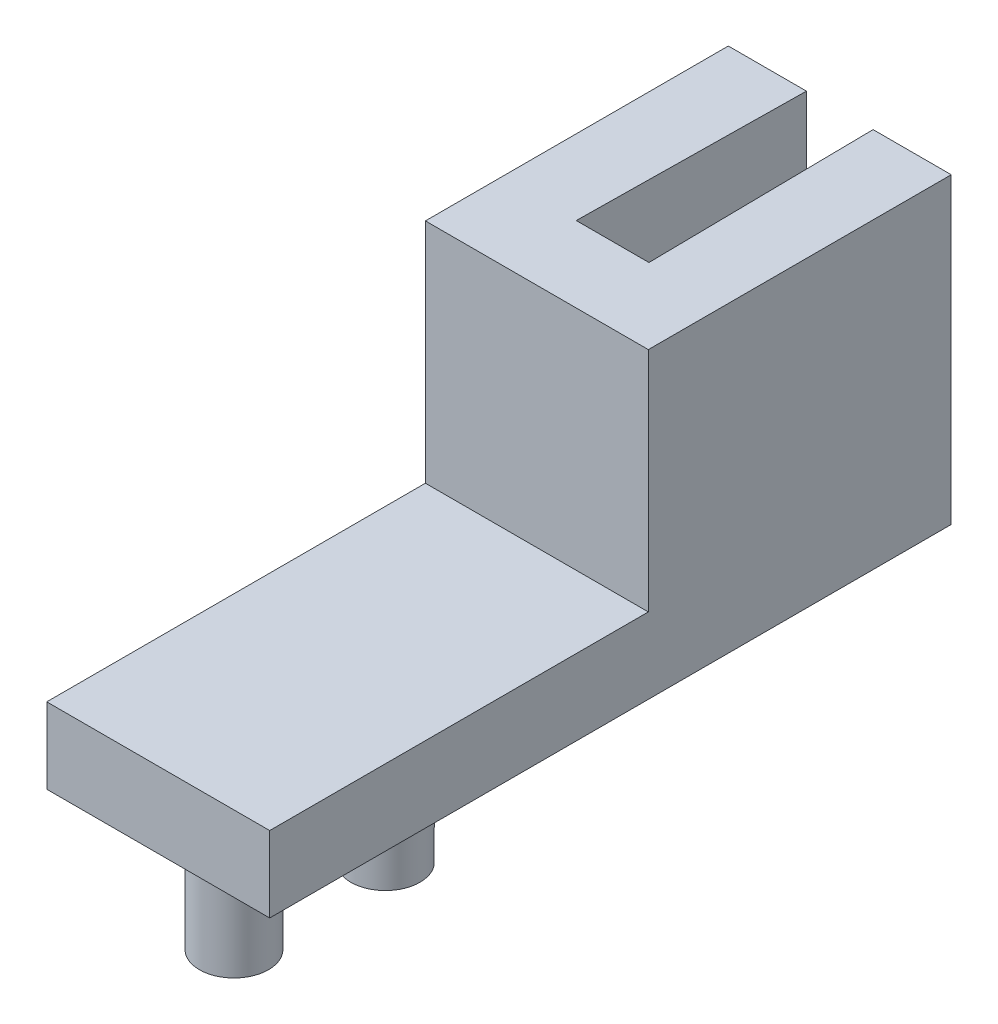
ISO-10303-21;
HEADER;
FILE_DESCRIPTION(('STEP AP214'),'2;1');
FILE_NAME('part.step','',(''),(''),'','','');
FILE_SCHEMA(('AUTOMOTIVE_DESIGN { 1 0 10303 214 1 1 1 1 }'));
ENDSEC;
DATA;
#1=APPLICATION_CONTEXT('core data for automotive mechanical design processes');
#2=APPLICATION_PROTOCOL_DEFINITION('international standard','automotive_design',2000,#1);
#3=PRODUCT_CONTEXT('',#1,'mechanical');
#4=PRODUCT('Part','Part','',(#3));
#5=PRODUCT_RELATED_PRODUCT_CATEGORY('part','',(#4));
#6=PRODUCT_DEFINITION_FORMATION('','',#4);
#7=PRODUCT_DEFINITION_CONTEXT('part definition',#1,'design');
#8=PRODUCT_DEFINITION('design','',#6,#7);
#9=PRODUCT_DEFINITION_SHAPE('','',#8);
#10=(LENGTH_UNIT() NAMED_UNIT(*) SI_UNIT(.MILLI.,.METRE.));
#11=(NAMED_UNIT(*) PLANE_ANGLE_UNIT() SI_UNIT($,.RADIAN.));
#12=(NAMED_UNIT(*) SI_UNIT($,.STERADIAN.) SOLID_ANGLE_UNIT());
#13=UNCERTAINTY_MEASURE_WITH_UNIT(LENGTH_MEASURE(1.E-05),#10,'distance_accuracy_value','');
#14=(GEOMETRIC_REPRESENTATION_CONTEXT(3) GLOBAL_UNCERTAINTY_ASSIGNED_CONTEXT((#13)) GLOBAL_UNIT_ASSIGNED_CONTEXT((#10,
#11,#12)) REPRESENTATION_CONTEXT('',''));
#15=CARTESIAN_POINT('',(0.,0.,0.));
#16=DIRECTION('',(0.,0.,1.));
#17=DIRECTION('',(1.,0.,0.));
#18=AXIS2_PLACEMENT_3D('',#15,#16,#17);
#19=CARTESIAN_POINT('',(9.3472,-3.175,0.));
#20=DIRECTION('',(0.,1.,0.));
#21=DIRECTION('',(0.,0.,1.));
#22=AXIS2_PLACEMENT_3D('',#19,#20,#21);
#23=PLANE('',#22);
#24=CARTESIAN_POINT('',(4.6736,-3.175,6.35));
#25=DIRECTION('',(0.,1.,0.));
#26=DIRECTION('',(0.,0.,1.));
#27=AXIS2_PLACEMENT_3D('',#24,#25,#26);
#28=CIRCLE('',#27,1.45);
#29=CARTESIAN_POINT('',(4.6736,-3.175,7.8));
#30=VERTEX_POINT('',#29);
#31=EDGE_CURVE('E11',#30,#30,#28,.F.);
#32=ORIENTED_EDGE('',*,*,#31,.F.);
#33=EDGE_LOOP('',(#32));
#34=FACE_BOUND('',#33,.T.);
#35=CARTESIAN_POINT('',(4.6736,-3.175,12.7));
#36=DIRECTION('',(0.,1.,0.));
#37=DIRECTION('',(0.,0.,1.));
#38=AXIS2_PLACEMENT_3D('',#35,#36,#37);
#39=CIRCLE('',#38,1.45);
#40=CARTESIAN_POINT('',(4.6736,-3.175,14.15));
#41=VERTEX_POINT('',#40);
#42=EDGE_CURVE('E49',#41,#41,#39,.F.);
#43=ORIENTED_EDGE('',*,*,#42,.F.);
#44=EDGE_LOOP('',(#43));
#45=FACE_BOUND('',#44,.T.);
#46=DIRECTION('',(0.0133321483061494,0.,0.999911122961207));
#47=VECTOR('',#46,1.);
#48=CARTESIAN_POINT('',(6.23882420902951,-3.175,-0.0831843227870598));
#49=LINE('',#48,#47);
#50=CARTESIAN_POINT('',(6.0706,-3.175,-12.7));
#51=VERTEX_POINT('',#50);
#52=CARTESIAN_POINT('',(6.1976,-3.175,-3.175));
#53=VERTEX_POINT('',#52);
#54=EDGE_CURVE('E192',#51,#53,#49,.T.);
#55=ORIENTED_EDGE('',*,*,#54,.F.);
#56=DIRECTION('',(-1.,0.,0.));
#57=VECTOR('',#56,1.);
#58=CARTESIAN_POINT('',(9.3472,-3.175,-12.7));
#59=LINE('',#58,#57);
#60=CARTESIAN_POINT('',(9.3472,-3.175,-12.7));
#61=VERTEX_POINT('',#60);
#62=EDGE_CURVE('E175',#61,#51,#59,.T.);
#63=ORIENTED_EDGE('',*,*,#62,.F.);
#64=DIRECTION('',(0.,0.,-1.));
#65=VECTOR('',#64,1.);
#66=CARTESIAN_POINT('',(9.3472,-3.175,0.));
#67=LINE('',#66,#65);
#68=CARTESIAN_POINT('',(9.3472,-3.175,15.875));
#69=VERTEX_POINT('',#68);
#70=EDGE_CURVE('E162',#69,#61,#67,.T.);
#71=ORIENTED_EDGE('',*,*,#70,.F.);
#72=DIRECTION('',(-1.,0.,0.));
#73=VECTOR('',#72,1.);
#74=CARTESIAN_POINT('',(9.3472,-3.175,15.875));
#75=LINE('',#74,#73);
#76=CARTESIAN_POINT('',(0.,-3.175,15.875));
#77=VERTEX_POINT('',#76);
#78=EDGE_CURVE('E138',#69,#77,#75,.T.);
#79=ORIENTED_EDGE('',*,*,#78,.T.);
#80=DIRECTION('',(0.,0.,-1.));
#81=VECTOR('',#80,1.);
#82=CARTESIAN_POINT('',(0.,-3.175,0.));
#83=LINE('',#82,#81);
#84=CARTESIAN_POINT('',(0.,-3.175,-12.7));
#85=VERTEX_POINT('',#84);
#86=EDGE_CURVE('E142',#77,#85,#83,.T.);
#87=ORIENTED_EDGE('',*,*,#86,.T.);
#88=CARTESIAN_POINT('',(3.2766,-3.175,-12.7));
#89=VERTEX_POINT('',#88);
#90=EDGE_CURVE('E174',#89,#85,#59,.T.);
#91=ORIENTED_EDGE('',*,*,#90,.F.);
#92=DIRECTION('',(-0.0133321483061496,0.,0.999911122961207));
#93=VECTOR('',#92,1.);
#94=CARTESIAN_POINT('',(3.10671436189122,-3.175,0.04142285815855));
#95=LINE('',#94,#93);
#96=CARTESIAN_POINT('',(3.1496,-3.175,-3.175));
#97=VERTEX_POINT('',#96);
#98=EDGE_CURVE('E204',#89,#97,#95,.T.);
#99=ORIENTED_EDGE('',*,*,#98,.T.);
#100=DIRECTION('',(1.,0.,0.));
#101=VECTOR('',#100,1.);
#102=CARTESIAN_POINT('',(0.,-3.175,-3.175));
#103=LINE('',#102,#101);
#104=EDGE_CURVE('E196',#97,#53,#103,.T.);
#105=ORIENTED_EDGE('',*,*,#104,.T.);
#106=EDGE_LOOP('',(#55,#63,#71,#79,#87,#91,#99,#105));
#107=FACE_BOUND('',#106,.T.);
#108=ADVANCED_FACE('F41',(#34,#45,#107),#23,.F.);
#109=CARTESIAN_POINT('',(9.3472,0.,-12.7));
#110=DIRECTION('',(0.,0.,1.));
#111=DIRECTION('',(1.,0.,0.));
#112=AXIS2_PLACEMENT_3D('',#109,#110,#111);
#113=PLANE('',#112);
#114=DIRECTION('',(0.,1.,0.));
#115=VECTOR('',#114,1.);
#116=CARTESIAN_POINT('',(6.0706,-3.175,-12.7));
#117=LINE('',#116,#115);
#118=CARTESIAN_POINT('',(6.0706,9.525,-12.7));
#119=VERTEX_POINT('',#118);
#120=EDGE_CURVE('E209',#51,#119,#117,.T.);
#121=ORIENTED_EDGE('',*,*,#120,.T.);
#122=DIRECTION('',(-1.,0.,0.));
#123=VECTOR('',#122,1.);
#124=CARTESIAN_POINT('',(9.3472,9.525,-12.7));
#125=LINE('',#124,#123);
#126=CARTESIAN_POINT('',(9.3472,9.525,-12.7));
#127=VERTEX_POINT('',#126);
#128=EDGE_CURVE('E170',#127,#119,#125,.T.);
#129=ORIENTED_EDGE('',*,*,#128,.F.);
#130=DIRECTION('',(0.,1.,0.));
#131=VECTOR('',#130,1.);
#132=CARTESIAN_POINT('',(9.3472,0.,-12.7));
#133=LINE('',#132,#131);
#134=EDGE_CURVE('E101',#61,#127,#133,.T.);
#135=ORIENTED_EDGE('',*,*,#134,.F.);
#136=ORIENTED_EDGE('',*,*,#62,.T.);
#137=EDGE_LOOP('',(#121,#129,#135,#136));
#138=FACE_BOUND('',#137,.T.);
#139=ADVANCED_FACE('F185',(#138),#113,.F.);
#140=CARTESIAN_POINT('',(9.3472,9.525,0.));
#141=DIRECTION('',(0.,1.,0.));
#142=DIRECTION('',(0.,0.,1.));
#143=AXIS2_PLACEMENT_3D('',#140,#141,#142);
#144=PLANE('',#143);
#145=ORIENTED_EDGE('',*,*,#128,.T.);
#146=DIRECTION('',(0.0133321483061494,0.,0.999911122961207));
#147=VECTOR('',#146,1.);
#148=CARTESIAN_POINT('',(6.23882420902951,9.525,-0.0831843227870598));
#149=LINE('',#148,#147);
#150=CARTESIAN_POINT('',(6.1976,9.525,-3.175));
#151=VERTEX_POINT('',#150);
#152=EDGE_CURVE('E219',#119,#151,#149,.T.);
#153=ORIENTED_EDGE('',*,*,#152,.T.);
#154=DIRECTION('',(1.,0.,0.));
#155=VECTOR('',#154,1.);
#156=CARTESIAN_POINT('',(0.,9.525,-3.175));
#157=LINE('',#156,#155);
#158=CARTESIAN_POINT('',(3.1496,9.525,-3.175));
#159=VERTEX_POINT('',#158);
#160=EDGE_CURVE('E205',#159,#151,#157,.T.);
#161=ORIENTED_EDGE('',*,*,#160,.F.);
#162=DIRECTION('',(-0.0133321483061496,0.,0.999911122961207));
#163=VECTOR('',#162,1.);
#164=CARTESIAN_POINT('',(3.10671436189122,9.525,0.04142285815855));
#165=LINE('',#164,#163);
#166=CARTESIAN_POINT('',(3.2766,9.525,-12.7));
#167=VERTEX_POINT('',#166);
#168=EDGE_CURVE('E238',#167,#159,#165,.T.);
#169=ORIENTED_EDGE('',*,*,#168,.F.);
#170=CARTESIAN_POINT('',(0.,9.525,-12.7));
#171=VERTEX_POINT('',#170);
#172=EDGE_CURVE('E169',#167,#171,#125,.T.);
#173=ORIENTED_EDGE('',*,*,#172,.T.);
#174=DIRECTION('',(0.,0.,-1.));
#175=VECTOR('',#174,1.);
#176=CARTESIAN_POINT('',(0.,9.525,0.));
#177=LINE('',#176,#175);
#178=CARTESIAN_POINT('',(0.,9.525,0.));
#179=VERTEX_POINT('',#178);
#180=EDGE_CURVE('E151',#179,#171,#177,.T.);
#181=ORIENTED_EDGE('',*,*,#180,.F.);
#182=DIRECTION('',(-1.,0.,0.));
#183=VECTOR('',#182,1.);
#184=CARTESIAN_POINT('',(9.3472,9.525,0.));
#185=LINE('',#184,#183);
#186=CARTESIAN_POINT('',(9.3472,9.525,0.));
#187=VERTEX_POINT('',#186);
#188=EDGE_CURVE('E124',#187,#179,#185,.T.);
#189=ORIENTED_EDGE('',*,*,#188,.F.);
#190=DIRECTION('',(0.,0.,-1.));
#191=VECTOR('',#190,1.);
#192=CARTESIAN_POINT('',(9.3472,9.525,0.));
#193=LINE('',#192,#191);
#194=EDGE_CURVE('E131',#187,#127,#193,.T.);
#195=ORIENTED_EDGE('',*,*,#194,.T.);
#196=EDGE_LOOP('',(#145,#153,#161,#169,#173,#181,#189,#195));
#197=FACE_BOUND('',#196,.T.);
#198=ADVANCED_FACE('F217',(#197),#144,.T.);
#199=ORIENTED_EDGE('',*,*,#172,.F.);
#200=DIRECTION('',(0.,1.,0.));
#201=VECTOR('',#200,1.);
#202=CARTESIAN_POINT('',(3.2766,-3.175,-12.7));
#203=LINE('',#202,#201);
#204=EDGE_CURVE('E56',#89,#167,#203,.T.);
#205=ORIENTED_EDGE('',*,*,#204,.F.);
#206=ORIENTED_EDGE('',*,*,#90,.T.);
#207=DIRECTION('',(0.,1.,0.));
#208=VECTOR('',#207,1.);
#209=CARTESIAN_POINT('',(0.,0.,-12.7));
#210=LINE('',#209,#208);
#211=EDGE_CURVE('E146',#85,#171,#210,.T.);
#212=ORIENTED_EDGE('',*,*,#211,.T.);
#213=EDGE_LOOP('',(#199,#205,#206,#212));
#214=FACE_BOUND('',#213,.T.);
#215=ADVANCED_FACE('F298',(#214),#113,.F.);
#216=CARTESIAN_POINT('',(9.3472,0.,0.));
#217=DIRECTION('',(0.,0.,1.));
#218=DIRECTION('',(0.,-1.,0.));
#219=AXIS2_PLACEMENT_3D('',#216,#217,#218);
#220=PLANE('',#219);
#221=DIRECTION('',(0.,1.,0.));
#222=VECTOR('',#221,1.);
#223=CARTESIAN_POINT('',(0.,0.,0.));
#224=LINE('',#223,#222);
#225=CARTESIAN_POINT('',(0.,0.,0.));
#226=VERTEX_POINT('',#225);
#227=EDGE_CURVE('E118',#226,#179,#224,.T.);
#228=ORIENTED_EDGE('',*,*,#227,.F.);
#229=DIRECTION('',(-1.,0.,0.));
#230=VECTOR('',#229,1.);
#231=CARTESIAN_POINT('',(9.3472,0.,0.));
#232=LINE('',#231,#230);
#233=CARTESIAN_POINT('',(9.3472,0.,0.));
#234=VERTEX_POINT('',#233);
#235=EDGE_CURVE('E113',#234,#226,#232,.T.);
#236=ORIENTED_EDGE('',*,*,#235,.F.);
#237=DIRECTION('',(0.,1.,0.));
#238=VECTOR('',#237,1.);
#239=CARTESIAN_POINT('',(9.3472,0.,0.));
#240=LINE('',#239,#238);
#241=EDGE_CURVE('E116',#234,#187,#240,.T.);
#242=ORIENTED_EDGE('',*,*,#241,.T.);
#243=ORIENTED_EDGE('',*,*,#188,.T.);
#244=EDGE_LOOP('',(#228,#236,#242,#243));
#245=FACE_BOUND('',#244,.T.);
#246=ADVANCED_FACE('F115',(#245),#220,.T.);
#247=CARTESIAN_POINT('',(9.3472,0.,0.));
#248=DIRECTION('',(0.,1.,0.));
#249=DIRECTION('',(0.,0.,1.));
#250=AXIS2_PLACEMENT_3D('',#247,#248,#249);
#251=PLANE('',#250);
#252=DIRECTION('',(0.,0.,-1.));
#253=VECTOR('',#252,1.);
#254=CARTESIAN_POINT('',(0.,0.,0.));
#255=LINE('',#254,#253);
#256=CARTESIAN_POINT('',(0.,0.,15.875));
#257=VERTEX_POINT('',#256);
#258=EDGE_CURVE('E157',#257,#226,#255,.T.);
#259=ORIENTED_EDGE('',*,*,#258,.F.);
#260=DIRECTION('',(-1.,0.,0.));
#261=VECTOR('',#260,1.);
#262=CARTESIAN_POINT('',(9.3472,0.,15.875));
#263=LINE('',#262,#261);
#264=CARTESIAN_POINT('',(9.3472,0.,15.875));
#265=VERTEX_POINT('',#264);
#266=EDGE_CURVE('E125',#265,#257,#263,.T.);
#267=ORIENTED_EDGE('',*,*,#266,.F.);
#268=DIRECTION('',(0.,0.,-1.));
#269=VECTOR('',#268,1.);
#270=CARTESIAN_POINT('',(9.3472,0.,0.));
#271=LINE('',#270,#269);
#272=EDGE_CURVE('E129',#265,#234,#271,.T.);
#273=ORIENTED_EDGE('',*,*,#272,.T.);
#274=ORIENTED_EDGE('',*,*,#235,.T.);
#275=EDGE_LOOP('',(#259,#267,#273,#274));
#276=FACE_BOUND('',#275,.T.);
#277=ADVANCED_FACE('F134',(#276),#251,.T.);
#278=CARTESIAN_POINT('',(9.3472,0.,15.875));
#279=DIRECTION('',(0.,0.,-1.));
#280=DIRECTION('',(0.,1.,0.));
#281=AXIS2_PLACEMENT_3D('',#278,#279,#280);
#282=PLANE('',#281);
#283=DIRECTION('',(0.,-1.,0.));
#284=VECTOR('',#283,1.);
#285=CARTESIAN_POINT('',(0.,0.,15.875));
#286=LINE('',#285,#284);
#287=EDGE_CURVE('E92',#257,#77,#286,.T.);
#288=ORIENTED_EDGE('',*,*,#287,.T.);
#289=ORIENTED_EDGE('',*,*,#78,.F.);
#290=DIRECTION('',(0.,-1.,0.));
#291=VECTOR('',#290,1.);
#292=CARTESIAN_POINT('',(9.3472,0.,15.875));
#293=LINE('',#292,#291);
#294=EDGE_CURVE('E65',#265,#69,#293,.T.);
#295=ORIENTED_EDGE('',*,*,#294,.F.);
#296=ORIENTED_EDGE('',*,*,#266,.T.);
#297=EDGE_LOOP('',(#288,#289,#295,#296));
#298=FACE_BOUND('',#297,.T.);
#299=ADVANCED_FACE('F288',(#298),#282,.F.);
#300=CARTESIAN_POINT('',(9.3472,0.,0.));
#301=DIRECTION('',(1.,0.,0.));
#302=DIRECTION('',(0.,0.,-1.));
#303=AXIS2_PLACEMENT_3D('',#300,#301,#302);
#304=PLANE('',#303);
#305=ORIENTED_EDGE('',*,*,#70,.T.);
#306=ORIENTED_EDGE('',*,*,#134,.T.);
#307=ORIENTED_EDGE('',*,*,#194,.F.);
#308=ORIENTED_EDGE('',*,*,#241,.F.);
#309=ORIENTED_EDGE('',*,*,#272,.F.);
#310=ORIENTED_EDGE('',*,*,#294,.T.);
#311=EDGE_LOOP('',(#305,#306,#307,#308,#309,#310));
#312=FACE_BOUND('',#311,.T.);
#313=ADVANCED_FACE('F128',(#312),#304,.T.);
#314=CARTESIAN_POINT('',(0.,0.,0.));
#315=DIRECTION('',(1.,0.,0.));
#316=DIRECTION('',(0.,0.,-1.));
#317=AXIS2_PLACEMENT_3D('',#314,#315,#316);
#318=PLANE('',#317);
#319=ORIENTED_EDGE('',*,*,#86,.F.);
#320=ORIENTED_EDGE('',*,*,#287,.F.);
#321=ORIENTED_EDGE('',*,*,#258,.T.);
#322=ORIENTED_EDGE('',*,*,#227,.T.);
#323=ORIENTED_EDGE('',*,*,#180,.T.);
#324=ORIENTED_EDGE('',*,*,#211,.F.);
#325=EDGE_LOOP('',(#319,#320,#321,#322,#323,#324));
#326=FACE_BOUND('',#325,.T.);
#327=ADVANCED_FACE('F285',(#326),#318,.F.);
#328=CARTESIAN_POINT('',(6.23882420902951,-3.175,-0.0831843227870598));
#329=DIRECTION('',(-0.999911122961207,0.,0.0133321483061494));
#330=DIRECTION('',(0.0133321483061494,0.,0.999911122961207));
#331=AXIS2_PLACEMENT_3D('',#328,#329,#330);
#332=PLANE('',#331);
#333=ORIENTED_EDGE('',*,*,#152,.F.);
#334=ORIENTED_EDGE('',*,*,#120,.F.);
#335=ORIENTED_EDGE('',*,*,#54,.T.);
#336=DIRECTION('',(0.,1.,0.));
#337=VECTOR('',#336,1.);
#338=CARTESIAN_POINT('',(6.1976,-3.175,-3.175));
#339=LINE('',#338,#337);
#340=EDGE_CURVE('E147',#53,#151,#339,.T.);
#341=ORIENTED_EDGE('',*,*,#340,.T.);
#342=EDGE_LOOP('',(#333,#334,#335,#341));
#343=FACE_BOUND('',#342,.T.);
#344=ADVANCED_FACE('F279',(#343),#332,.T.);
#345=CARTESIAN_POINT('',(0.,-3.175,-3.175));
#346=DIRECTION('',(0.,0.,1.));
#347=DIRECTION('',(1.,0.,0.));
#348=AXIS2_PLACEMENT_3D('',#345,#346,#347);
#349=PLANE('',#348);
#350=ORIENTED_EDGE('',*,*,#160,.T.);
#351=ORIENTED_EDGE('',*,*,#340,.F.);
#352=ORIENTED_EDGE('',*,*,#104,.F.);
#353=DIRECTION('',(0.,1.,0.));
#354=VECTOR('',#353,1.);
#355=CARTESIAN_POINT('',(3.1496,-3.175,-3.175));
#356=LINE('',#355,#354);
#357=EDGE_CURVE('E229',#97,#159,#356,.T.);
#358=ORIENTED_EDGE('',*,*,#357,.T.);
#359=EDGE_LOOP('',(#350,#351,#352,#358));
#360=FACE_BOUND('',#359,.T.);
#361=ADVANCED_FACE('F276',(#360),#349,.F.);
#362=CARTESIAN_POINT('',(3.10671436189122,-3.175,0.04142285815855));
#363=DIRECTION('',(-0.999911122961207,0.,-0.0133321483061496));
#364=DIRECTION('',(-0.0133321483061496,0.,0.999911122961207));
#365=AXIS2_PLACEMENT_3D('',#362,#363,#364);
#366=PLANE('',#365);
#367=ORIENTED_EDGE('',*,*,#168,.T.);
#368=ORIENTED_EDGE('',*,*,#357,.F.);
#369=ORIENTED_EDGE('',*,*,#98,.F.);
#370=ORIENTED_EDGE('',*,*,#204,.T.);
#371=EDGE_LOOP('',(#367,#368,#369,#370));
#372=FACE_BOUND('',#371,.T.);
#373=ADVANCED_FACE('F274',(#372),#366,.F.);
#374=CARTESIAN_POINT('',(4.6736,-8.255,12.7));
#375=DIRECTION('',(0.,1.,0.));
#376=DIRECTION('',(0.,0.,1.));
#377=AXIS2_PLACEMENT_3D('',#374,#375,#376);
#378=CYLINDRICAL_SURFACE('',#377,1.45);
#379=CARTESIAN_POINT('',(4.6736,-8.255,12.7));
#380=DIRECTION('',(0.,-1.,0.));
#381=DIRECTION('',(0.,0.,-1.));
#382=AXIS2_PLACEMENT_3D('',#379,#380,#381);
#383=CIRCLE('',#382,1.45);
#384=CARTESIAN_POINT('',(4.6736,-8.255,11.25));
#385=VERTEX_POINT('',#384);
#386=EDGE_CURVE('E243',#385,#385,#383,.T.);
#387=ORIENTED_EDGE('',*,*,#386,.F.);
#388=EDGE_LOOP('',(#387));
#389=FACE_BOUND('',#388,.T.);
#390=ORIENTED_EDGE('',*,*,#42,.T.);
#391=EDGE_LOOP('',(#390));
#392=FACE_BOUND('',#391,.T.);
#393=ADVANCED_FACE('F181',(#389,#392),#378,.T.);
#394=CARTESIAN_POINT('',(4.6736,-8.255,12.7));
#395=DIRECTION('',(0.,-1.,0.));
#396=DIRECTION('',(0.,0.,-1.));
#397=AXIS2_PLACEMENT_3D('',#394,#395,#396);
#398=PLANE('',#397);
#399=ORIENTED_EDGE('',*,*,#386,.T.);
#400=EDGE_LOOP('',(#399));
#401=FACE_BOUND('',#400,.T.);
#402=ADVANCED_FACE('F261',(#401),#398,.T.);
#403=CARTESIAN_POINT('',(4.6736,-8.255,6.35));
#404=DIRECTION('',(0.,1.,0.));
#405=DIRECTION('',(0.,0.,1.));
#406=AXIS2_PLACEMENT_3D('',#403,#404,#405);
#407=CYLINDRICAL_SURFACE('',#406,1.45);
#408=CARTESIAN_POINT('',(4.6736,-8.255,6.35));
#409=DIRECTION('',(0.,-1.,0.));
#410=DIRECTION('',(0.,0.,-1.));
#411=AXIS2_PLACEMENT_3D('',#408,#409,#410);
#412=CIRCLE('',#411,1.45);
#413=CARTESIAN_POINT('',(4.6736,-8.255,4.9));
#414=VERTEX_POINT('',#413);
#415=EDGE_CURVE('E251',#414,#414,#412,.T.);
#416=ORIENTED_EDGE('',*,*,#415,.F.);
#417=EDGE_LOOP('',(#416));
#418=FACE_BOUND('',#417,.T.);
#419=ORIENTED_EDGE('',*,*,#31,.T.);
#420=EDGE_LOOP('',(#419));
#421=FACE_BOUND('',#420,.T.);
#422=ADVANCED_FACE('F258',(#418,#421),#407,.T.);
#423=CARTESIAN_POINT('',(4.6736,-8.255,6.35));
#424=DIRECTION('',(0.,-1.,0.));
#425=DIRECTION('',(0.,0.,-1.));
#426=AXIS2_PLACEMENT_3D('',#423,#424,#425);
#427=PLANE('',#426);
#428=ORIENTED_EDGE('',*,*,#415,.T.);
#429=EDGE_LOOP('',(#428));
#430=FACE_BOUND('',#429,.T.);
#431=ADVANCED_FACE('F256',(#430),#427,.T.);
#432=CLOSED_SHELL('',(#108,#139,#198,#215,#246,#277,#299,#313,#327,#344,#361,#373,#393,#402,
#422,#431));
#433=MANIFOLD_SOLID_BREP('B2',#432);
#434=ADVANCED_BREP_SHAPE_REPRESENTATION('',(#18,#433),#14);
#435=SHAPE_DEFINITION_REPRESENTATION(#9,#434);
ENDSEC;
END-ISO-10303-21;
